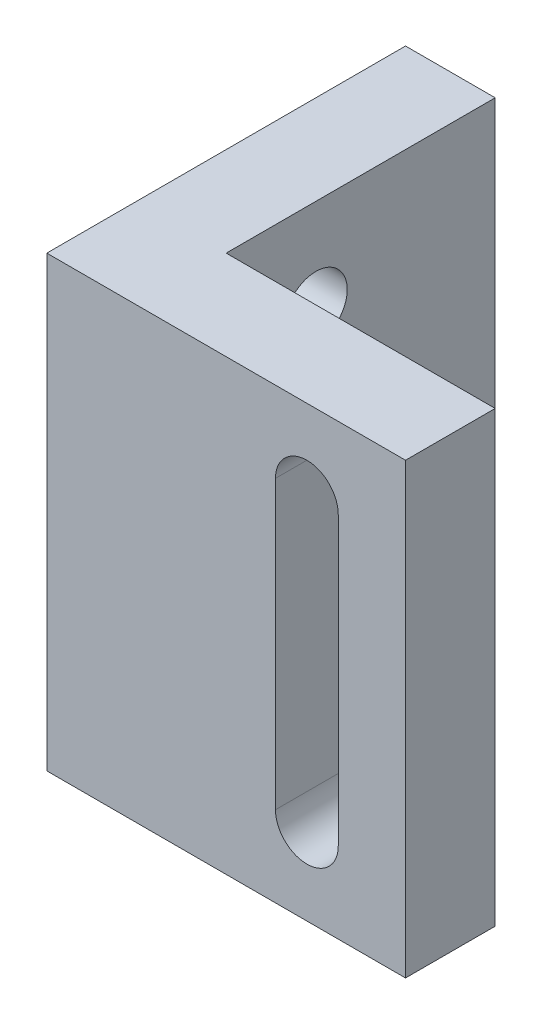
ISO-10303-21;
HEADER;
FILE_DESCRIPTION(('STEP AP214'),'2;1');
FILE_NAME('part.step','',(''),(''),'','','');
FILE_SCHEMA(('AUTOMOTIVE_DESIGN { 1 0 10303 214 1 1 1 1 }'));
ENDSEC;
DATA;
#1=APPLICATION_CONTEXT('core data for automotive mechanical design processes');
#2=APPLICATION_PROTOCOL_DEFINITION('international standard','automotive_design',2000,#1);
#3=PRODUCT_CONTEXT('',#1,'mechanical');
#4=PRODUCT('Part','Part','',(#3));
#5=PRODUCT_RELATED_PRODUCT_CATEGORY('part','',(#4));
#6=PRODUCT_DEFINITION_FORMATION('','',#4);
#7=PRODUCT_DEFINITION_CONTEXT('part definition',#1,'design');
#8=PRODUCT_DEFINITION('design','',#6,#7);
#9=PRODUCT_DEFINITION_SHAPE('','',#8);
#10=(LENGTH_UNIT() NAMED_UNIT(*) SI_UNIT(.MILLI.,.METRE.));
#11=(NAMED_UNIT(*) PLANE_ANGLE_UNIT() SI_UNIT($,.RADIAN.));
#12=(NAMED_UNIT(*) SI_UNIT($,.STERADIAN.) SOLID_ANGLE_UNIT());
#13=UNCERTAINTY_MEASURE_WITH_UNIT(LENGTH_MEASURE(1.E-05),#10,'distance_accuracy_value','');
#14=(GEOMETRIC_REPRESENTATION_CONTEXT(3) GLOBAL_UNCERTAINTY_ASSIGNED_CONTEXT((#13)) GLOBAL_UNIT_ASSIGNED_CONTEXT((#10,
#11,#12)) REPRESENTATION_CONTEXT('',''));
#15=CARTESIAN_POINT('',(0.,0.,0.));
#16=DIRECTION('',(0.,0.,1.));
#17=DIRECTION('',(1.,0.,0.));
#18=AXIS2_PLACEMENT_3D('',#15,#16,#17);
#19=CARTESIAN_POINT('',(0.,25.,-15.));
#20=DIRECTION('',(0.,0.,1.));
#21=DIRECTION('',(1.,0.,0.));
#22=AXIS2_PLACEMENT_3D('',#19,#20,#21);
#23=PLANE('',#22);
#24=DIRECTION('',(-1.,0.,0.));
#25=VECTOR('',#24,1.);
#26=CARTESIAN_POINT('',(0.,0.,-15.));
#27=LINE('',#26,#25);
#28=CARTESIAN_POINT('',(0.,0.,-15.));
#29=VERTEX_POINT('',#28);
#30=CARTESIAN_POINT('',(-5.,0.,-15.));
#31=VERTEX_POINT('',#30);
#32=EDGE_CURVE('E154',#29,#31,#27,.T.);
#33=ORIENTED_EDGE('',*,*,#32,.T.);
#34=DIRECTION('',(0.,-1.,0.));
#35=VECTOR('',#34,1.);
#36=CARTESIAN_POINT('',(-5.,25.,-15.));
#37=LINE('',#36,#35);
#38=CARTESIAN_POINT('',(-5.,25.,-15.));
#39=VERTEX_POINT('',#38);
#40=EDGE_CURVE('E11',#39,#31,#37,.T.);
#41=ORIENTED_EDGE('',*,*,#40,.F.);
#42=DIRECTION('',(-1.,0.,0.));
#43=VECTOR('',#42,1.);
#44=CARTESIAN_POINT('',(0.,25.,-15.));
#45=LINE('',#44,#43);
#46=CARTESIAN_POINT('',(0.,25.,-15.));
#47=VERTEX_POINT('',#46);
#48=EDGE_CURVE('E156',#47,#39,#45,.T.);
#49=ORIENTED_EDGE('',*,*,#48,.F.);
#50=DIRECTION('',(0.,-1.,0.));
#51=VECTOR('',#50,1.);
#52=CARTESIAN_POINT('',(0.,25.,-15.));
#53=LINE('',#52,#51);
#54=EDGE_CURVE('E176',#47,#29,#53,.T.);
#55=ORIENTED_EDGE('',*,*,#54,.T.);
#56=EDGE_LOOP('',(#33,#41,#49,#55));
#57=FACE_BOUND('',#56,.T.);
#58=ADVANCED_FACE('F39',(#57),#23,.F.);
#59=CARTESIAN_POINT('',(-5.,25.,-15.));
#60=DIRECTION('',(1.,0.,0.));
#61=DIRECTION('',(0.,0.,-1.));
#62=AXIS2_PLACEMENT_3D('',#59,#60,#61);
#63=PLANE('',#62);
#64=CARTESIAN_POINT('',(-5.,5.134,-5.));
#65=DIRECTION('',(-1.,0.,0.));
#66=DIRECTION('',(0.,0.,1.));
#67=AXIS2_PLACEMENT_3D('',#64,#65,#66);
#68=CIRCLE('',#67,1.75);
#69=CARTESIAN_POINT('',(-5.,5.134,-3.25));
#70=VERTEX_POINT('',#69);
#71=EDGE_CURVE('E360',#70,#70,#68,.T.);
#72=ORIENTED_EDGE('',*,*,#71,.F.);
#73=EDGE_LOOP('',(#72));
#74=FACE_BOUND('',#73,.T.);
#75=CARTESIAN_POINT('',(-5.,19.866,-5.));
#76=DIRECTION('',(-1.,0.,0.));
#77=DIRECTION('',(0.,0.,-1.));
#78=AXIS2_PLACEMENT_3D('',#75,#76,#77);
#79=CIRCLE('',#78,1.75);
#80=CARTESIAN_POINT('',(-5.,19.866,-6.75));
#81=VERTEX_POINT('',#80);
#82=EDGE_CURVE('E368',#81,#81,#79,.T.);
#83=ORIENTED_EDGE('',*,*,#82,.F.);
#84=EDGE_LOOP('',(#83));
#85=FACE_BOUND('',#84,.T.);
#86=DIRECTION('',(0.,0.,1.));
#87=VECTOR('',#86,1.);
#88=CARTESIAN_POINT('',(-5.,0.,-15.));
#89=LINE('',#88,#87);
#90=CARTESIAN_POINT('',(-5.,0.,5.));
#91=VERTEX_POINT('',#90);
#92=EDGE_CURVE('E180',#31,#91,#89,.T.);
#93=ORIENTED_EDGE('',*,*,#92,.T.);
#94=DIRECTION('',(0.,-1.,0.));
#95=VECTOR('',#94,1.);
#96=CARTESIAN_POINT('',(-5.,25.,5.));
#97=LINE('',#96,#95);
#98=CARTESIAN_POINT('',(-5.,25.,5.));
#99=VERTEX_POINT('',#98);
#100=EDGE_CURVE('E47',#99,#91,#97,.T.);
#101=ORIENTED_EDGE('',*,*,#100,.F.);
#102=DIRECTION('',(0.,0.,1.));
#103=VECTOR('',#102,1.);
#104=CARTESIAN_POINT('',(-5.,25.,-15.));
#105=LINE('',#104,#103);
#106=EDGE_CURVE('E160',#39,#99,#105,.T.);
#107=ORIENTED_EDGE('',*,*,#106,.F.);
#108=ORIENTED_EDGE('',*,*,#40,.T.);
#109=EDGE_LOOP('',(#93,#101,#107,#108));
#110=FACE_BOUND('',#109,.T.);
#111=ADVANCED_FACE('F235',(#74,#85,#110),#63,.F.);
#112=CARTESIAN_POINT('',(-5.,25.,5.));
#113=DIRECTION('',(0.,0.,-1.));
#114=DIRECTION('',(-1.,0.,0.));
#115=AXIS2_PLACEMENT_3D('',#112,#113,#114);
#116=PLANE('',#115);
#117=DIRECTION('',(0.,-1.,0.));
#118=VECTOR('',#117,1.);
#119=CARTESIAN_POINT('',(7.75,20.5,5.));
#120=LINE('',#119,#118);
#121=CARTESIAN_POINT('',(7.75,20.5,5.));
#122=VERTEX_POINT('',#121);
#123=CARTESIAN_POINT('',(7.74999999999999,4.5,5.));
#124=VERTEX_POINT('',#123);
#125=EDGE_CURVE('E376',#122,#124,#120,.T.);
#126=ORIENTED_EDGE('',*,*,#125,.F.);
#127=CARTESIAN_POINT('',(9.5,20.5,5.));
#128=DIRECTION('',(0.,0.,-1.));
#129=DIRECTION('',(-1.,0.,0.));
#130=AXIS2_PLACEMENT_3D('',#127,#128,#129);
#131=CIRCLE('',#130,1.75);
#132=CARTESIAN_POINT('',(11.25,20.5,5.));
#133=VERTEX_POINT('',#132);
#134=EDGE_CURVE('E155',#133,#122,#131,.F.);
#135=ORIENTED_EDGE('',*,*,#134,.F.);
#136=DIRECTION('',(0.,1.,0.));
#137=VECTOR('',#136,1.);
#138=CARTESIAN_POINT('',(11.25,20.5,5.));
#139=LINE('',#138,#137);
#140=CARTESIAN_POINT('',(11.25,4.5,5.));
#141=VERTEX_POINT('',#140);
#142=EDGE_CURVE('E151',#141,#133,#139,.T.);
#143=ORIENTED_EDGE('',*,*,#142,.F.);
#144=CARTESIAN_POINT('',(9.5,4.5,5.));
#145=DIRECTION('',(0.,0.,-1.));
#146=DIRECTION('',(-1.,0.,0.));
#147=AXIS2_PLACEMENT_3D('',#144,#145,#146);
#148=CIRCLE('',#147,1.75);
#149=EDGE_CURVE('E122',#124,#141,#148,.F.);
#150=ORIENTED_EDGE('',*,*,#149,.F.);
#151=EDGE_LOOP('',(#126,#135,#143,#150));
#152=FACE_BOUND('',#151,.T.);
#153=DIRECTION('',(1.,0.,0.));
#154=VECTOR('',#153,1.);
#155=CARTESIAN_POINT('',(-5.,0.,5.));
#156=LINE('',#155,#154);
#157=CARTESIAN_POINT('',(15.,0.,5.));
#158=VERTEX_POINT('',#157);
#159=EDGE_CURVE('E183',#91,#158,#156,.T.);
#160=ORIENTED_EDGE('',*,*,#159,.T.);
#161=DIRECTION('',(0.,-1.,0.));
#162=VECTOR('',#161,1.);
#163=CARTESIAN_POINT('',(15.,25.,5.));
#164=LINE('',#163,#162);
#165=CARTESIAN_POINT('',(15.,25.,5.));
#166=VERTEX_POINT('',#165);
#167=EDGE_CURVE('E205',#166,#158,#164,.T.);
#168=ORIENTED_EDGE('',*,*,#167,.F.);
#169=DIRECTION('',(1.,0.,0.));
#170=VECTOR('',#169,1.);
#171=CARTESIAN_POINT('',(-5.,25.,5.));
#172=LINE('',#171,#170);
#173=EDGE_CURVE('E164',#99,#166,#172,.T.);
#174=ORIENTED_EDGE('',*,*,#173,.F.);
#175=ORIENTED_EDGE('',*,*,#100,.T.);
#176=EDGE_LOOP('',(#160,#168,#174,#175));
#177=FACE_BOUND('',#176,.T.);
#178=ADVANCED_FACE('F214',(#152,#177),#116,.F.);
#179=CARTESIAN_POINT('',(15.,25.,5.));
#180=DIRECTION('',(-1.,0.,0.));
#181=DIRECTION('',(0.,0.,1.));
#182=AXIS2_PLACEMENT_3D('',#179,#180,#181);
#183=PLANE('',#182);
#184=DIRECTION('',(0.,0.,-1.));
#185=VECTOR('',#184,1.);
#186=CARTESIAN_POINT('',(15.,0.,5.));
#187=LINE('',#186,#185);
#188=CARTESIAN_POINT('',(15.,0.,0.));
#189=VERTEX_POINT('',#188);
#190=EDGE_CURVE('E186',#158,#189,#187,.T.);
#191=ORIENTED_EDGE('',*,*,#190,.T.);
#192=DIRECTION('',(0.,-1.,0.));
#193=VECTOR('',#192,1.);
#194=CARTESIAN_POINT('',(15.,25.,0.));
#195=LINE('',#194,#193);
#196=CARTESIAN_POINT('',(15.,25.,0.));
#197=VERTEX_POINT('',#196);
#198=EDGE_CURVE('E201',#197,#189,#195,.T.);
#199=ORIENTED_EDGE('',*,*,#198,.F.);
#200=DIRECTION('',(0.,0.,-1.));
#201=VECTOR('',#200,1.);
#202=CARTESIAN_POINT('',(15.,25.,5.));
#203=LINE('',#202,#201);
#204=EDGE_CURVE('E167',#166,#197,#203,.T.);
#205=ORIENTED_EDGE('',*,*,#204,.F.);
#206=ORIENTED_EDGE('',*,*,#167,.T.);
#207=EDGE_LOOP('',(#191,#199,#205,#206));
#208=FACE_BOUND('',#207,.T.);
#209=ADVANCED_FACE('F225',(#208),#183,.F.);
#210=CARTESIAN_POINT('',(15.,25.,0.));
#211=DIRECTION('',(0.,0.,1.));
#212=DIRECTION('',(1.,0.,0.));
#213=AXIS2_PLACEMENT_3D('',#210,#211,#212);
#214=PLANE('',#213);
#215=DIRECTION('',(0.,-1.,0.));
#216=VECTOR('',#215,1.);
#217=CARTESIAN_POINT('',(11.25,20.5,0.));
#218=LINE('',#217,#216);
#219=CARTESIAN_POINT('',(11.25,20.5,0.));
#220=VERTEX_POINT('',#219);
#221=CARTESIAN_POINT('',(11.25,4.5,0.));
#222=VERTEX_POINT('',#221);
#223=EDGE_CURVE('E129',#220,#222,#218,.T.);
#224=ORIENTED_EDGE('',*,*,#223,.F.);
#225=CARTESIAN_POINT('',(9.5,20.5,0.));
#226=DIRECTION('',(0.,0.,-1.));
#227=DIRECTION('',(-1.,0.,0.));
#228=AXIS2_PLACEMENT_3D('',#225,#226,#227);
#229=CIRCLE('',#228,1.75);
#230=CARTESIAN_POINT('',(7.74999999999999,20.5,0.));
#231=VERTEX_POINT('',#230);
#232=EDGE_CURVE('E62',#231,#220,#229,.T.);
#233=ORIENTED_EDGE('',*,*,#232,.F.);
#234=DIRECTION('',(0.,1.,0.));
#235=VECTOR('',#234,1.);
#236=CARTESIAN_POINT('',(7.74999999999999,20.5,0.));
#237=LINE('',#236,#235);
#238=CARTESIAN_POINT('',(7.74999999999999,4.5,0.));
#239=VERTEX_POINT('',#238);
#240=EDGE_CURVE('E137',#239,#231,#237,.T.);
#241=ORIENTED_EDGE('',*,*,#240,.F.);
#242=CARTESIAN_POINT('',(9.5,4.5,0.));
#243=DIRECTION('',(0.,0.,-1.));
#244=DIRECTION('',(-1.,0.,0.));
#245=AXIS2_PLACEMENT_3D('',#242,#243,#244);
#246=CIRCLE('',#245,1.75);
#247=EDGE_CURVE('E119',#222,#239,#246,.T.);
#248=ORIENTED_EDGE('',*,*,#247,.F.);
#249=EDGE_LOOP('',(#224,#233,#241,#248));
#250=FACE_BOUND('',#249,.T.);
#251=DIRECTION('',(-1.,0.,0.));
#252=VECTOR('',#251,1.);
#253=CARTESIAN_POINT('',(15.,0.,0.));
#254=LINE('',#253,#252);
#255=CARTESIAN_POINT('',(0.,0.,0.));
#256=VERTEX_POINT('',#255);
#257=EDGE_CURVE('E189',#189,#256,#254,.T.);
#258=ORIENTED_EDGE('',*,*,#257,.T.);
#259=DIRECTION('',(0.,-1.,0.));
#260=VECTOR('',#259,1.);
#261=CARTESIAN_POINT('',(0.,25.,0.));
#262=LINE('',#261,#260);
#263=CARTESIAN_POINT('',(0.,25.,0.));
#264=VERTEX_POINT('',#263);
#265=EDGE_CURVE('E197',#264,#256,#262,.T.);
#266=ORIENTED_EDGE('',*,*,#265,.F.);
#267=DIRECTION('',(-1.,0.,0.));
#268=VECTOR('',#267,1.);
#269=CARTESIAN_POINT('',(15.,25.,0.));
#270=LINE('',#269,#268);
#271=EDGE_CURVE('E170',#197,#264,#270,.T.);
#272=ORIENTED_EDGE('',*,*,#271,.F.);
#273=ORIENTED_EDGE('',*,*,#198,.T.);
#274=EDGE_LOOP('',(#258,#266,#272,#273));
#275=FACE_BOUND('',#274,.T.);
#276=ADVANCED_FACE('F134',(#250,#275),#214,.F.);
#277=CARTESIAN_POINT('',(0.,25.,0.));
#278=DIRECTION('',(-1.,0.,0.));
#279=DIRECTION('',(0.,0.,1.));
#280=AXIS2_PLACEMENT_3D('',#277,#278,#279);
#281=PLANE('',#280);
#282=CARTESIAN_POINT('',(0.,5.134,-5.));
#283=DIRECTION('',(-1.,0.,0.));
#284=DIRECTION('',(0.,0.,1.));
#285=AXIS2_PLACEMENT_3D('',#282,#283,#284);
#286=CIRCLE('',#285,1.75);
#287=CARTESIAN_POINT('',(0.,5.134,-3.25));
#288=VERTEX_POINT('',#287);
#289=EDGE_CURVE('E358',#288,#288,#286,.F.);
#290=ORIENTED_EDGE('',*,*,#289,.F.);
#291=EDGE_LOOP('',(#290));
#292=FACE_BOUND('',#291,.T.);
#293=CARTESIAN_POINT('',(0.,19.866,-5.));
#294=DIRECTION('',(-1.,0.,0.));
#295=DIRECTION('',(0.,0.,1.));
#296=AXIS2_PLACEMENT_3D('',#293,#294,#295);
#297=CIRCLE('',#296,1.75);
#298=CARTESIAN_POINT('',(0.,19.866,-3.25));
#299=VERTEX_POINT('',#298);
#300=EDGE_CURVE('E362',#299,#299,#297,.F.);
#301=ORIENTED_EDGE('',*,*,#300,.F.);
#302=EDGE_LOOP('',(#301));
#303=FACE_BOUND('',#302,.T.);
#304=DIRECTION('',(0.,0.,-1.));
#305=VECTOR('',#304,1.);
#306=CARTESIAN_POINT('',(0.,0.,0.));
#307=LINE('',#306,#305);
#308=EDGE_CURVE('E161',#256,#29,#307,.T.);
#309=ORIENTED_EDGE('',*,*,#308,.T.);
#310=ORIENTED_EDGE('',*,*,#54,.F.);
#311=DIRECTION('',(0.,0.,-1.));
#312=VECTOR('',#311,1.);
#313=CARTESIAN_POINT('',(0.,25.,0.));
#314=LINE('',#313,#312);
#315=EDGE_CURVE('E173',#264,#47,#314,.T.);
#316=ORIENTED_EDGE('',*,*,#315,.F.);
#317=ORIENTED_EDGE('',*,*,#265,.T.);
#318=EDGE_LOOP('',(#309,#310,#316,#317));
#319=FACE_BOUND('',#318,.T.);
#320=ADVANCED_FACE('F238',(#292,#303,#319),#281,.F.);
#321=CARTESIAN_POINT('',(0.,25.,0.));
#322=DIRECTION('',(0.,1.,0.));
#323=DIRECTION('',(0.,0.,1.));
#324=AXIS2_PLACEMENT_3D('',#321,#322,#323);
#325=PLANE('',#324);
#326=ORIENTED_EDGE('',*,*,#48,.T.);
#327=ORIENTED_EDGE('',*,*,#106,.T.);
#328=ORIENTED_EDGE('',*,*,#173,.T.);
#329=ORIENTED_EDGE('',*,*,#204,.T.);
#330=ORIENTED_EDGE('',*,*,#271,.T.);
#331=ORIENTED_EDGE('',*,*,#315,.T.);
#332=EDGE_LOOP('',(#326,#327,#328,#329,#330,#331));
#333=FACE_BOUND('',#332,.T.);
#334=ADVANCED_FACE('F231',(#333),#325,.T.);
#335=CARTESIAN_POINT('',(0.,0.,0.));
#336=DIRECTION('',(0.,1.,0.));
#337=DIRECTION('',(0.,0.,1.));
#338=AXIS2_PLACEMENT_3D('',#335,#336,#337);
#339=PLANE('',#338);
#340=ORIENTED_EDGE('',*,*,#32,.F.);
#341=ORIENTED_EDGE('',*,*,#308,.F.);
#342=ORIENTED_EDGE('',*,*,#257,.F.);
#343=ORIENTED_EDGE('',*,*,#190,.F.);
#344=ORIENTED_EDGE('',*,*,#159,.F.);
#345=ORIENTED_EDGE('',*,*,#92,.F.);
#346=EDGE_LOOP('',(#340,#341,#342,#343,#344,#345));
#347=FACE_BOUND('',#346,.T.);
#348=ADVANCED_FACE('F220',(#347),#339,.F.);
#349=CARTESIAN_POINT('',(9.5,20.5,24.811612756159));
#350=DIRECTION('',(0.,0.,-1.));
#351=DIRECTION('',(-1.,0.,0.));
#352=AXIS2_PLACEMENT_3D('',#349,#350,#351);
#353=CYLINDRICAL_SURFACE('',#352,1.75);
#354=ORIENTED_EDGE('',*,*,#134,.T.);
#355=DIRECTION('',(0.,0.,-1.));
#356=VECTOR('',#355,1.);
#357=CARTESIAN_POINT('',(7.75,20.5,24.811612756159));
#358=LINE('',#357,#356);
#359=EDGE_CURVE('E144',#122,#231,#358,.T.);
#360=ORIENTED_EDGE('',*,*,#359,.T.);
#361=ORIENTED_EDGE('',*,*,#232,.T.);
#362=DIRECTION('',(0.,0.,-1.));
#363=VECTOR('',#362,1.);
#364=CARTESIAN_POINT('',(11.25,20.5,24.8116127561589));
#365=LINE('',#364,#363);
#366=EDGE_CURVE('E126',#133,#220,#365,.T.);
#367=ORIENTED_EDGE('',*,*,#366,.F.);
#368=EDGE_LOOP('',(#354,#360,#361,#367));
#369=FACE_BOUND('',#368,.T.);
#370=ADVANCED_FACE('F283',(#369),#353,.F.);
#371=CARTESIAN_POINT('',(7.75,20.5,24.811612756159));
#372=DIRECTION('',(-1.,0.,0.));
#373=DIRECTION('',(0.,0.,1.));
#374=AXIS2_PLACEMENT_3D('',#371,#372,#373);
#375=PLANE('',#374);
#376=ORIENTED_EDGE('',*,*,#125,.T.);
#377=DIRECTION('',(0.,0.,-1.));
#378=VECTOR('',#377,1.);
#379=CARTESIAN_POINT('',(7.75,4.5,24.811612756159));
#380=LINE('',#379,#378);
#381=EDGE_CURVE('E125',#124,#239,#380,.T.);
#382=ORIENTED_EDGE('',*,*,#381,.T.);
#383=ORIENTED_EDGE('',*,*,#240,.T.);
#384=ORIENTED_EDGE('',*,*,#359,.F.);
#385=EDGE_LOOP('',(#376,#382,#383,#384));
#386=FACE_BOUND('',#385,.T.);
#387=ADVANCED_FACE('F288',(#386),#375,.F.);
#388=CARTESIAN_POINT('',(9.5,4.5,24.811612756159));
#389=DIRECTION('',(0.,0.,-1.));
#390=DIRECTION('',(-1.,0.,0.));
#391=AXIS2_PLACEMENT_3D('',#388,#389,#390);
#392=CYLINDRICAL_SURFACE('',#391,1.75);
#393=ORIENTED_EDGE('',*,*,#149,.T.);
#394=DIRECTION('',(0.,0.,-1.));
#395=VECTOR('',#394,1.);
#396=CARTESIAN_POINT('',(11.25,4.5,24.8116127561589));
#397=LINE('',#396,#395);
#398=EDGE_CURVE('E54',#141,#222,#397,.T.);
#399=ORIENTED_EDGE('',*,*,#398,.T.);
#400=ORIENTED_EDGE('',*,*,#247,.T.);
#401=ORIENTED_EDGE('',*,*,#381,.F.);
#402=EDGE_LOOP('',(#393,#399,#400,#401));
#403=FACE_BOUND('',#402,.T.);
#404=ADVANCED_FACE('F116',(#403),#392,.F.);
#405=CARTESIAN_POINT('',(11.25,20.5,24.8116127561589));
#406=DIRECTION('',(1.,0.,0.));
#407=DIRECTION('',(0.,0.,-1.));
#408=AXIS2_PLACEMENT_3D('',#405,#406,#407);
#409=PLANE('',#408);
#410=ORIENTED_EDGE('',*,*,#142,.T.);
#411=ORIENTED_EDGE('',*,*,#366,.T.);
#412=ORIENTED_EDGE('',*,*,#223,.T.);
#413=ORIENTED_EDGE('',*,*,#398,.F.);
#414=EDGE_LOOP('',(#410,#411,#412,#413));
#415=FACE_BOUND('',#414,.T.);
#416=ADVANCED_FACE('F130',(#415),#409,.F.);
#417=CARTESIAN_POINT('',(4.94974746830583,19.866,-5.));
#418=DIRECTION('',(-1.,0.,0.));
#419=DIRECTION('',(0.,0.,1.));
#420=AXIS2_PLACEMENT_3D('',#417,#418,#419);
#421=CYLINDRICAL_SURFACE('',#420,1.75);
#422=ORIENTED_EDGE('',*,*,#300,.T.);
#423=EDGE_LOOP('',(#422));
#424=FACE_BOUND('',#423,.T.);
#425=ORIENTED_EDGE('',*,*,#82,.T.);
#426=EDGE_LOOP('',(#425));
#427=FACE_BOUND('',#426,.T.);
#428=ADVANCED_FACE('F315',(#424,#427),#421,.F.);
#429=CARTESIAN_POINT('',(4.94974746830583,5.134,-5.));
#430=DIRECTION('',(-1.,0.,0.));
#431=DIRECTION('',(0.,0.,1.));
#432=AXIS2_PLACEMENT_3D('',#429,#430,#431);
#433=CYLINDRICAL_SURFACE('',#432,1.75);
#434=ORIENTED_EDGE('',*,*,#289,.T.);
#435=EDGE_LOOP('',(#434));
#436=FACE_BOUND('',#435,.T.);
#437=ORIENTED_EDGE('',*,*,#71,.T.);
#438=EDGE_LOOP('',(#437));
#439=FACE_BOUND('',#438,.T.);
#440=ADVANCED_FACE('F334',(#436,#439),#433,.F.);
#441=CLOSED_SHELL('',(#58,#111,#178,#209,#276,#320,#334,#348,#370,#387,#404,#416,#428,#440));
#442=MANIFOLD_SOLID_BREP('B2',#441);
#443=ADVANCED_BREP_SHAPE_REPRESENTATION('',(#18,#442),#14);
#444=SHAPE_DEFINITION_REPRESENTATION(#9,#443);
ENDSEC;
END-ISO-10303-21;
